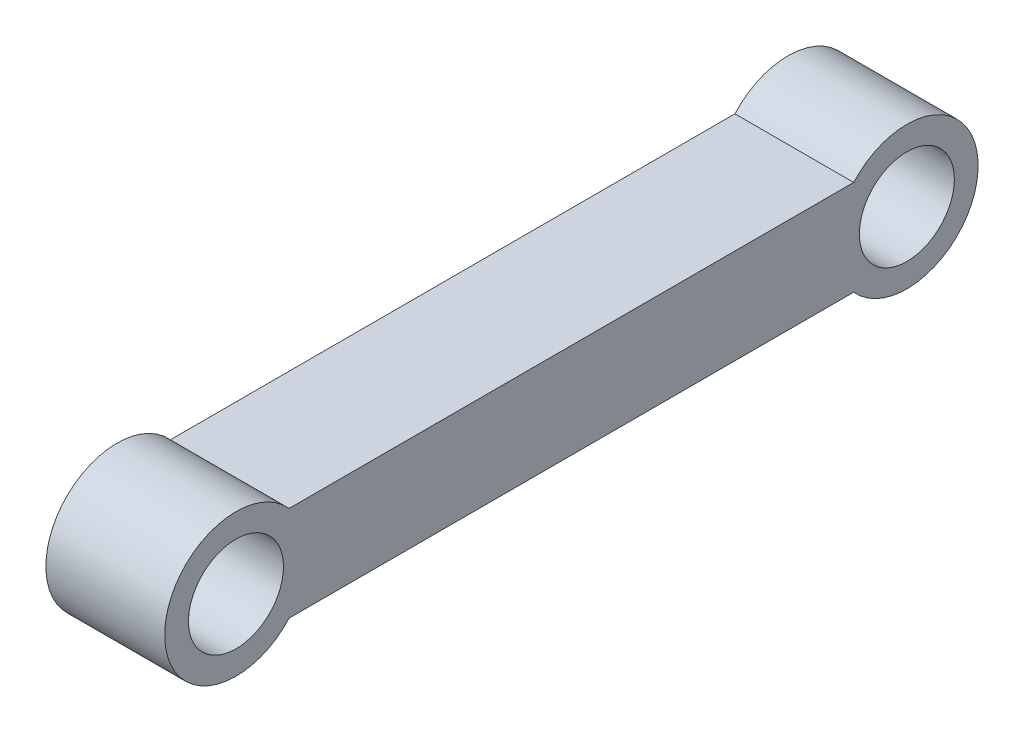
ISO-10303-21;
HEADER;
FILE_DESCRIPTION(('STEP AP214'),'2;1');
FILE_NAME('part.step','',(''),(''),'','','');
FILE_SCHEMA(('AUTOMOTIVE_DESIGN { 1 0 10303 214 1 1 1 1 }'));
ENDSEC;
DATA;
#1=APPLICATION_CONTEXT('core data for automotive mechanical design processes');
#2=APPLICATION_PROTOCOL_DEFINITION('international standard','automotive_design',2000,#1);
#3=PRODUCT_CONTEXT('',#1,'mechanical');
#4=PRODUCT('Part','Part','',(#3));
#5=PRODUCT_RELATED_PRODUCT_CATEGORY('part','',(#4));
#6=PRODUCT_DEFINITION_FORMATION('','',#4);
#7=PRODUCT_DEFINITION_CONTEXT('part definition',#1,'design');
#8=PRODUCT_DEFINITION('design','',#6,#7);
#9=PRODUCT_DEFINITION_SHAPE('','',#8);
#10=(LENGTH_UNIT() NAMED_UNIT(*) SI_UNIT(.MILLI.,.METRE.));
#11=(NAMED_UNIT(*) PLANE_ANGLE_UNIT() SI_UNIT($,.RADIAN.));
#12=(NAMED_UNIT(*) SI_UNIT($,.STERADIAN.) SOLID_ANGLE_UNIT());
#13=UNCERTAINTY_MEASURE_WITH_UNIT(LENGTH_MEASURE(1.E-05),#10,'distance_accuracy_value','');
#14=(GEOMETRIC_REPRESENTATION_CONTEXT(3) GLOBAL_UNCERTAINTY_ASSIGNED_CONTEXT((#13)) GLOBAL_UNIT_ASSIGNED_CONTEXT((#10,
#11,#12)) REPRESENTATION_CONTEXT('',''));
#15=CARTESIAN_POINT('',(0.,0.,0.));
#16=DIRECTION('',(0.,0.,1.));
#17=DIRECTION('',(1.,0.,0.));
#18=AXIS2_PLACEMENT_3D('',#15,#16,#17);
#19=CARTESIAN_POINT('',(100.,-226.263273144617,304.96553858004));
#20=DIRECTION('',(1.,0.,0.));
#21=DIRECTION('',(0.,0.,-1.));
#22=AXIS2_PLACEMENT_3D('',#19,#20,#21);
#23=PLANE('',#22);
#24=CARTESIAN_POINT('',(100.,-226.263273144619,-259.65446141996));
#25=DIRECTION('',(1.,0.,0.));
#26=DIRECTION('',(0.,0.,-1.));
#27=AXIS2_PLACEMENT_3D('',#24,#25,#26);
#28=CIRCLE('',#27,40.0000000000001);
#29=CARTESIAN_POINT('',(100.,-226.263273144619,-299.65446141996));
#30=VERTEX_POINT('',#29);
#31=EDGE_CURVE('E106',#30,#30,#28,.T.);
#32=ORIENTED_EDGE('',*,*,#31,.F.);
#33=EDGE_LOOP('',(#32));
#34=FACE_BOUND('',#33,.T.);
#35=CARTESIAN_POINT('',(100.,-226.263273144617,304.96553858004));
#36=DIRECTION('',(1.,0.,0.));
#37=DIRECTION('',(0.,0.,-1.));
#38=AXIS2_PLACEMENT_3D('',#35,#36,#37);
#39=CIRCLE('',#38,60.);
#40=CARTESIAN_POINT('',(100.,-186.263273144617,260.244179030044));
#41=VERTEX_POINT('',#40);
#42=CARTESIAN_POINT('',(100.,-266.263273144617,260.244179030044));
#43=VERTEX_POINT('',#42);
#44=EDGE_CURVE('E91',#41,#43,#39,.T.);
#45=ORIENTED_EDGE('',*,*,#44,.T.);
#46=DIRECTION('',(0.,0.,-1.));
#47=VECTOR('',#46,1.);
#48=CARTESIAN_POINT('',(100.,-266.263273144617,260.244179030044));
#49=LINE('',#48,#47);
#50=CARTESIAN_POINT('',(100.,-266.263273144618,-214.933101869964));
#51=VERTEX_POINT('',#50);
#52=EDGE_CURVE('E86',#43,#51,#49,.T.);
#53=ORIENTED_EDGE('',*,*,#52,.T.);
#54=CARTESIAN_POINT('',(100.,-226.263273144619,-259.65446141996));
#55=DIRECTION('',(1.,0.,0.));
#56=DIRECTION('',(0.,0.,-1.));
#57=AXIS2_PLACEMENT_3D('',#54,#55,#56);
#58=CIRCLE('',#57,60.);
#59=CARTESIAN_POINT('',(100.,-186.263273144618,-214.933101869965));
#60=VERTEX_POINT('',#59);
#61=EDGE_CURVE('E89',#51,#60,#58,.T.);
#62=ORIENTED_EDGE('',*,*,#61,.T.);
#63=DIRECTION('',(0.,0.,1.));
#64=VECTOR('',#63,1.);
#65=CARTESIAN_POINT('',(100.,-186.263273144617,260.244179030044));
#66=LINE('',#65,#64);
#67=EDGE_CURVE('E56',#60,#41,#66,.T.);
#68=ORIENTED_EDGE('',*,*,#67,.T.);
#69=EDGE_LOOP('',(#45,#53,#62,#68));
#70=FACE_BOUND('',#69,.T.);
#71=CARTESIAN_POINT('',(100.,-226.263273144617,304.96553858004));
#72=DIRECTION('',(1.,0.,0.));
#73=DIRECTION('',(0.,0.,-1.));
#74=AXIS2_PLACEMENT_3D('',#71,#72,#73);
#75=CIRCLE('',#74,39.9999999999999);
#76=CARTESIAN_POINT('',(100.,-226.263273144617,264.96553858004));
#77=VERTEX_POINT('',#76);
#78=EDGE_CURVE('E121',#77,#77,#75,.T.);
#79=ORIENTED_EDGE('',*,*,#78,.F.);
#80=EDGE_LOOP('',(#79));
#81=FACE_BOUND('',#80,.T.);
#82=ADVANCED_FACE('F39',(#34,#70,#81),#23,.T.);
#83=CARTESIAN_POINT('',(0.,-226.263273144617,304.96553858004));
#84=DIRECTION('',(1.,0.,0.));
#85=DIRECTION('',(0.,0.,-1.));
#86=AXIS2_PLACEMENT_3D('',#83,#84,#85);
#87=PLANE('',#86);
#88=CARTESIAN_POINT('',(0.,-226.263273144617,304.96553858004));
#89=DIRECTION('',(1.,0.,0.));
#90=DIRECTION('',(0.,0.,-1.));
#91=AXIS2_PLACEMENT_3D('',#88,#89,#90);
#92=CIRCLE('',#91,60.);
#93=CARTESIAN_POINT('',(0.,-186.263273144617,260.244179030044));
#94=VERTEX_POINT('',#93);
#95=CARTESIAN_POINT('',(0.,-266.263273144617,260.244179030044));
#96=VERTEX_POINT('',#95);
#97=EDGE_CURVE('E103',#94,#96,#92,.T.);
#98=ORIENTED_EDGE('',*,*,#97,.F.);
#99=DIRECTION('',(0.,0.,1.));
#100=VECTOR('',#99,1.);
#101=CARTESIAN_POINT('',(0.,-186.263273144617,260.244179030044));
#102=LINE('',#101,#100);
#103=CARTESIAN_POINT('',(0.,-186.263273144618,-214.933101869965));
#104=VERTEX_POINT('',#103);
#105=EDGE_CURVE('E79',#104,#94,#102,.T.);
#106=ORIENTED_EDGE('',*,*,#105,.F.);
#107=CARTESIAN_POINT('',(0.,-226.263273144619,-259.65446141996));
#108=DIRECTION('',(1.,0.,0.));
#109=DIRECTION('',(0.,0.,-1.));
#110=AXIS2_PLACEMENT_3D('',#107,#108,#109);
#111=CIRCLE('',#110,60.);
#112=CARTESIAN_POINT('',(0.,-266.263273144618,-214.933101869964));
#113=VERTEX_POINT('',#112);
#114=EDGE_CURVE('E73',#113,#104,#111,.T.);
#115=ORIENTED_EDGE('',*,*,#114,.F.);
#116=DIRECTION('',(0.,0.,-1.));
#117=VECTOR('',#116,1.);
#118=CARTESIAN_POINT('',(0.,-266.263273144617,260.244179030044));
#119=LINE('',#118,#117);
#120=EDGE_CURVE('E95',#96,#113,#119,.T.);
#121=ORIENTED_EDGE('',*,*,#120,.F.);
#122=EDGE_LOOP('',(#98,#106,#115,#121));
#123=FACE_BOUND('',#122,.T.);
#124=CARTESIAN_POINT('',(0.,-226.263273144619,-259.65446141996));
#125=DIRECTION('',(1.,0.,0.));
#126=DIRECTION('',(0.,0.,-1.));
#127=AXIS2_PLACEMENT_3D('',#124,#125,#126);
#128=CIRCLE('',#127,40.0000000000001);
#129=CARTESIAN_POINT('',(0.,-226.263273144619,-299.65446141996));
#130=VERTEX_POINT('',#129);
#131=EDGE_CURVE('E118',#130,#130,#128,.T.);
#132=ORIENTED_EDGE('',*,*,#131,.T.);
#133=EDGE_LOOP('',(#132));
#134=FACE_BOUND('',#133,.T.);
#135=CARTESIAN_POINT('',(0.,-226.263273144617,304.96553858004));
#136=DIRECTION('',(1.,0.,0.));
#137=DIRECTION('',(0.,0.,-1.));
#138=AXIS2_PLACEMENT_3D('',#135,#136,#137);
#139=CIRCLE('',#138,39.9999999999999);
#140=CARTESIAN_POINT('',(0.,-226.263273144617,264.96553858004));
#141=VERTEX_POINT('',#140);
#142=EDGE_CURVE('E124',#141,#141,#139,.T.);
#143=ORIENTED_EDGE('',*,*,#142,.T.);
#144=EDGE_LOOP('',(#143));
#145=FACE_BOUND('',#144,.T.);
#146=ADVANCED_FACE('F114',(#123,#134,#145),#87,.F.);
#147=CARTESIAN_POINT('',(100.,-226.263273144617,304.96553858004));
#148=DIRECTION('',(-1.,0.,0.));
#149=DIRECTION('',(0.,0.,1.));
#150=AXIS2_PLACEMENT_3D('',#147,#148,#149);
#151=CYLINDRICAL_SURFACE('',#150,60.);
#152=ORIENTED_EDGE('',*,*,#97,.T.);
#153=DIRECTION('',(-1.,0.,0.));
#154=VECTOR('',#153,1.);
#155=CARTESIAN_POINT('',(100.,-266.263273144617,260.244179030044));
#156=LINE('',#155,#154);
#157=EDGE_CURVE('E11',#43,#96,#156,.T.);
#158=ORIENTED_EDGE('',*,*,#157,.F.);
#159=ORIENTED_EDGE('',*,*,#44,.F.);
#160=DIRECTION('',(-1.,0.,0.));
#161=VECTOR('',#160,1.);
#162=CARTESIAN_POINT('',(100.,-186.263273144617,260.244179030044));
#163=LINE('',#162,#161);
#164=EDGE_CURVE('E99',#41,#94,#163,.T.);
#165=ORIENTED_EDGE('',*,*,#164,.T.);
#166=EDGE_LOOP('',(#152,#158,#159,#165));
#167=FACE_BOUND('',#166,.T.);
#168=ADVANCED_FACE('F41',(#167),#151,.T.);
#169=CARTESIAN_POINT('',(100.,-266.263273144617,260.244179030044));
#170=DIRECTION('',(0.,1.,0.));
#171=DIRECTION('',(0.,0.,1.));
#172=AXIS2_PLACEMENT_3D('',#169,#170,#171);
#173=PLANE('',#172);
#174=ORIENTED_EDGE('',*,*,#120,.T.);
#175=DIRECTION('',(-1.,0.,0.));
#176=VECTOR('',#175,1.);
#177=CARTESIAN_POINT('',(100.,-266.263273144618,-214.933101869964));
#178=LINE('',#177,#176);
#179=EDGE_CURVE('E48',#51,#113,#178,.T.);
#180=ORIENTED_EDGE('',*,*,#179,.F.);
#181=ORIENTED_EDGE('',*,*,#52,.F.);
#182=ORIENTED_EDGE('',*,*,#157,.T.);
#183=EDGE_LOOP('',(#174,#180,#181,#182));
#184=FACE_BOUND('',#183,.T.);
#185=ADVANCED_FACE('F94',(#184),#173,.F.);
#186=CARTESIAN_POINT('',(100.,-226.263273144619,-259.65446141996));
#187=DIRECTION('',(-1.,0.,0.));
#188=DIRECTION('',(0.,0.,1.));
#189=AXIS2_PLACEMENT_3D('',#186,#187,#188);
#190=CYLINDRICAL_SURFACE('',#189,60.);
#191=ORIENTED_EDGE('',*,*,#114,.T.);
#192=DIRECTION('',(-1.,0.,0.));
#193=VECTOR('',#192,1.);
#194=CARTESIAN_POINT('',(100.,-186.263273144618,-214.933101869965));
#195=LINE('',#194,#193);
#196=EDGE_CURVE('E96',#60,#104,#195,.T.);
#197=ORIENTED_EDGE('',*,*,#196,.F.);
#198=ORIENTED_EDGE('',*,*,#61,.F.);
#199=ORIENTED_EDGE('',*,*,#179,.T.);
#200=EDGE_LOOP('',(#191,#197,#198,#199));
#201=FACE_BOUND('',#200,.T.);
#202=ADVANCED_FACE('F97',(#201),#190,.T.);
#203=CARTESIAN_POINT('',(100.,-186.263273144617,260.244179030044));
#204=DIRECTION('',(0.,-1.,0.));
#205=DIRECTION('',(0.,0.,-1.));
#206=AXIS2_PLACEMENT_3D('',#203,#204,#205);
#207=PLANE('',#206);
#208=ORIENTED_EDGE('',*,*,#105,.T.);
#209=ORIENTED_EDGE('',*,*,#164,.F.);
#210=ORIENTED_EDGE('',*,*,#67,.F.);
#211=ORIENTED_EDGE('',*,*,#196,.T.);
#212=EDGE_LOOP('',(#208,#209,#210,#211));
#213=FACE_BOUND('',#212,.T.);
#214=ADVANCED_FACE('F111',(#213),#207,.F.);
#215=CARTESIAN_POINT('',(100.,-226.263273144619,-259.65446141996));
#216=DIRECTION('',(-1.,0.,0.));
#217=DIRECTION('',(0.,0.,1.));
#218=AXIS2_PLACEMENT_3D('',#215,#216,#217);
#219=CYLINDRICAL_SURFACE('',#218,40.0000000000001);
#220=ORIENTED_EDGE('',*,*,#31,.T.);
#221=EDGE_LOOP('',(#220));
#222=FACE_BOUND('',#221,.T.);
#223=ORIENTED_EDGE('',*,*,#131,.F.);
#224=EDGE_LOOP('',(#223));
#225=FACE_BOUND('',#224,.T.);
#226=ADVANCED_FACE('F141',(#222,#225),#219,.F.);
#227=CARTESIAN_POINT('',(100.,-226.263273144617,304.96553858004));
#228=DIRECTION('',(-1.,0.,0.));
#229=DIRECTION('',(0.,0.,1.));
#230=AXIS2_PLACEMENT_3D('',#227,#228,#229);
#231=CYLINDRICAL_SURFACE('',#230,39.9999999999999);
#232=ORIENTED_EDGE('',*,*,#78,.T.);
#233=EDGE_LOOP('',(#232));
#234=FACE_BOUND('',#233,.T.);
#235=ORIENTED_EDGE('',*,*,#142,.F.);
#236=EDGE_LOOP('',(#235));
#237=FACE_BOUND('',#236,.T.);
#238=ADVANCED_FACE('F130',(#234,#237),#231,.F.);
#239=CLOSED_SHELL('',(#82,#146,#168,#185,#202,#214,#226,#238));
#240=MANIFOLD_SOLID_BREP('B2',#239);
#241=ADVANCED_BREP_SHAPE_REPRESENTATION('',(#18,#240),#14);
#242=SHAPE_DEFINITION_REPRESENTATION(#9,#241);
ENDSEC;
END-ISO-10303-21;
